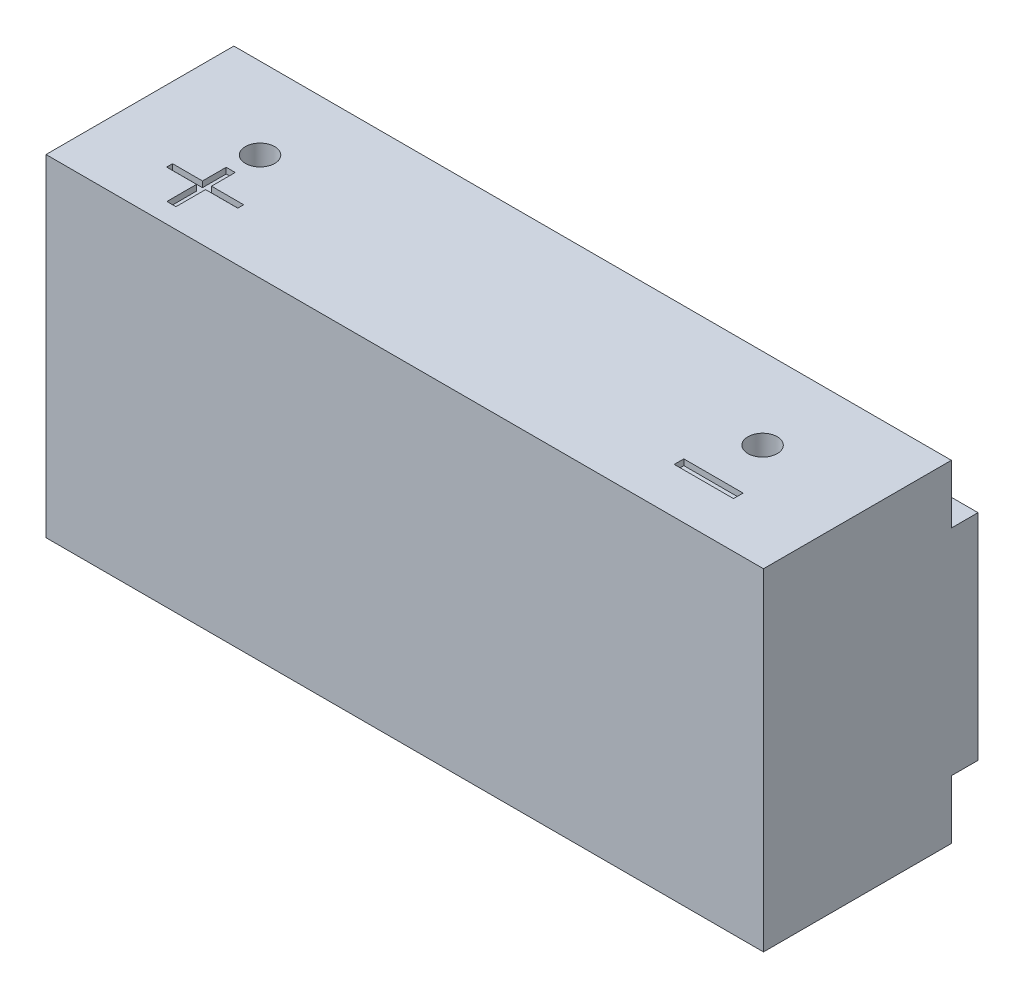
ISO-10303-21;
HEADER;
FILE_DESCRIPTION(('STEP AP214'),'2;1');
FILE_NAME('part.step','',(''),(''),'','','');
FILE_SCHEMA(('AUTOMOTIVE_DESIGN { 1 0 10303 214 1 1 1 1 }'));
ENDSEC;
DATA;
#1=APPLICATION_CONTEXT('core data for automotive mechanical design processes');
#2=APPLICATION_PROTOCOL_DEFINITION('international standard','automotive_design',2000,#1);
#3=PRODUCT_CONTEXT('',#1,'mechanical');
#4=PRODUCT('Part','Part','',(#3));
#5=PRODUCT_RELATED_PRODUCT_CATEGORY('part','',(#4));
#6=PRODUCT_DEFINITION_FORMATION('','',#4);
#7=PRODUCT_DEFINITION_CONTEXT('part definition',#1,'design');
#8=PRODUCT_DEFINITION('design','',#6,#7);
#9=PRODUCT_DEFINITION_SHAPE('','',#8);
#10=(LENGTH_UNIT() NAMED_UNIT(*) SI_UNIT(.MILLI.,.METRE.));
#11=(NAMED_UNIT(*) PLANE_ANGLE_UNIT() SI_UNIT($,.RADIAN.));
#12=(NAMED_UNIT(*) SI_UNIT($,.STERADIAN.) SOLID_ANGLE_UNIT());
#13=UNCERTAINTY_MEASURE_WITH_UNIT(LENGTH_MEASURE(1.E-05),#10,'distance_accuracy_value','');
#14=(GEOMETRIC_REPRESENTATION_CONTEXT(3) GLOBAL_UNCERTAINTY_ASSIGNED_CONTEXT((#13)) GLOBAL_UNIT_ASSIGNED_CONTEXT((#10,
#11,#12)) REPRESENTATION_CONTEXT('',''));
#15=CARTESIAN_POINT('',(0.,0.,0.));
#16=DIRECTION('',(0.,0.,1.));
#17=DIRECTION('',(1.,0.,0.));
#18=AXIS2_PLACEMENT_3D('',#15,#16,#17);
#19=CARTESIAN_POINT('',(0.,143.6878,-92.869200088));
#20=DIRECTION('',(0.,0.,1.));
#21=DIRECTION('',(1.,0.,0.));
#22=AXIS2_PLACEMENT_3D('',#19,#20,#21);
#23=PLANE('',#22);
#24=DIRECTION('',(1.,0.,0.));
#25=VECTOR('',#24,1.);
#26=CARTESIAN_POINT('',(0.,25.4,-92.869200088));
#27=LINE('',#26,#25);
#28=CARTESIAN_POINT('',(0.,25.4,-92.869200088));
#29=VERTEX_POINT('',#28);
#30=CARTESIAN_POINT('',(310.63946,25.4,-92.869200088));
#31=VERTEX_POINT('',#30);
#32=EDGE_CURVE('E400',#29,#31,#27,.T.);
#33=ORIENTED_EDGE('',*,*,#32,.F.);
#34=DIRECTION('',(0.,-1.,0.));
#35=VECTOR('',#34,1.);
#36=CARTESIAN_POINT('',(0.,143.6878,-92.869200088));
#37=LINE('',#36,#35);
#38=CARTESIAN_POINT('',(0.,118.2878,-92.869200088));
#39=VERTEX_POINT('',#38);
#40=EDGE_CURVE('E451',#39,#29,#37,.T.);
#41=ORIENTED_EDGE('',*,*,#40,.F.);
#42=DIRECTION('',(-1.,0.,0.));
#43=VECTOR('',#42,1.);
#44=CARTESIAN_POINT('',(0.,118.2878,-92.869200088));
#45=LINE('',#44,#43);
#46=CARTESIAN_POINT('',(310.63946,118.2878,-92.869200088));
#47=VERTEX_POINT('',#46);
#48=EDGE_CURVE('E49',#47,#39,#45,.T.);
#49=ORIENTED_EDGE('',*,*,#48,.F.);
#50=DIRECTION('',(0.,-1.,0.));
#51=VECTOR('',#50,1.);
#52=CARTESIAN_POINT('',(310.63946,143.6878,-92.869200088));
#53=LINE('',#52,#51);
#54=EDGE_CURVE('E463',#47,#31,#53,.T.);
#55=ORIENTED_EDGE('',*,*,#54,.T.);
#56=EDGE_LOOP('',(#33,#41,#49,#55));
#57=FACE_BOUND('',#56,.T.);
#58=ADVANCED_FACE('F40',(#57),#23,.F.);
#59=CARTESIAN_POINT('',(0.,143.6878,0.));
#60=DIRECTION('',(1.,0.,0.));
#61=DIRECTION('',(0.,0.,-1.));
#62=AXIS2_PLACEMENT_3D('',#59,#60,#61);
#63=PLANE('',#62);
#64=DIRECTION('',(0.,-1.,0.));
#65=VECTOR('',#64,1.);
#66=CARTESIAN_POINT('',(0.,25.4,-81.33842));
#67=LINE('',#66,#65);
#68=CARTESIAN_POINT('',(0.,25.4,-81.33842));
#69=VERTEX_POINT('',#68);
#70=CARTESIAN_POINT('',(0.,0.,-81.33842));
#71=VERTEX_POINT('',#70);
#72=EDGE_CURVE('E390',#69,#71,#67,.T.);
#73=ORIENTED_EDGE('',*,*,#72,.T.);
#74=DIRECTION('',(0.,0.,1.));
#75=VECTOR('',#74,1.);
#76=CARTESIAN_POINT('',(0.,0.,0.));
#77=LINE('',#76,#75);
#78=CARTESIAN_POINT('',(0.,0.,0.));
#79=VERTEX_POINT('',#78);
#80=EDGE_CURVE('E428',#71,#79,#77,.T.);
#81=ORIENTED_EDGE('',*,*,#80,.T.);
#82=DIRECTION('',(0.,-1.,0.));
#83=VECTOR('',#82,1.);
#84=CARTESIAN_POINT('',(0.,143.6878,0.));
#85=LINE('',#84,#83);
#86=CARTESIAN_POINT('',(0.,143.6878,0.));
#87=VERTEX_POINT('',#86);
#88=EDGE_CURVE('E471',#87,#79,#85,.T.);
#89=ORIENTED_EDGE('',*,*,#88,.F.);
#90=DIRECTION('',(0.,0.,1.));
#91=VECTOR('',#90,1.);
#92=CARTESIAN_POINT('',(0.,143.6878,0.));
#93=LINE('',#92,#91);
#94=CARTESIAN_POINT('',(0.,143.6878,-81.33842));
#95=VERTEX_POINT('',#94);
#96=EDGE_CURVE('E440',#95,#87,#93,.T.);
#97=ORIENTED_EDGE('',*,*,#96,.F.);
#98=DIRECTION('',(0.,1.,0.));
#99=VECTOR('',#98,1.);
#100=CARTESIAN_POINT('',(0.,118.2878,-81.33842));
#101=LINE('',#100,#99);
#102=CARTESIAN_POINT('',(0.,118.2878,-81.33842));
#103=VERTEX_POINT('',#102);
#104=EDGE_CURVE('E411',#103,#95,#101,.T.);
#105=ORIENTED_EDGE('',*,*,#104,.F.);
#106=DIRECTION('',(0.,0.,1.));
#107=VECTOR('',#106,1.);
#108=CARTESIAN_POINT('',(0.,118.2878,-94.03842));
#109=LINE('',#108,#107);
#110=EDGE_CURVE('E404',#39,#103,#109,.T.);
#111=ORIENTED_EDGE('',*,*,#110,.F.);
#112=ORIENTED_EDGE('',*,*,#40,.T.);
#113=DIRECTION('',(0.,0.,1.));
#114=VECTOR('',#113,1.);
#115=CARTESIAN_POINT('',(0.,25.4,-94.03842));
#116=LINE('',#115,#114);
#117=EDGE_CURVE('E382',#29,#69,#116,.T.);
#118=ORIENTED_EDGE('',*,*,#117,.T.);
#119=EDGE_LOOP('',(#73,#81,#89,#97,#105,#111,#112,#118));
#120=FACE_BOUND('',#119,.T.);
#121=ADVANCED_FACE('F42',(#120),#63,.F.);
#122=CARTESIAN_POINT('',(310.63946,143.6878,0.));
#123=DIRECTION('',(-1.,0.,0.));
#124=DIRECTION('',(0.,0.,1.));
#125=AXIS2_PLACEMENT_3D('',#122,#123,#124);
#126=PLANE('',#125);
#127=DIRECTION('',(0.,-1.,0.));
#128=VECTOR('',#127,1.);
#129=CARTESIAN_POINT('',(310.63946,143.6878,-81.33842));
#130=LINE('',#129,#128);
#131=CARTESIAN_POINT('',(310.63946,25.4,-81.33842));
#132=VERTEX_POINT('',#131);
#133=CARTESIAN_POINT('',(310.63946,0.,-81.33842));
#134=VERTEX_POINT('',#133);
#135=EDGE_CURVE('E397',#132,#134,#130,.T.);
#136=ORIENTED_EDGE('',*,*,#135,.F.);
#137=DIRECTION('',(0.,0.,1.));
#138=VECTOR('',#137,1.);
#139=CARTESIAN_POINT('',(310.63946,25.4,0.));
#140=LINE('',#139,#138);
#141=EDGE_CURVE('E11',#31,#132,#140,.T.);
#142=ORIENTED_EDGE('',*,*,#141,.F.);
#143=ORIENTED_EDGE('',*,*,#54,.F.);
#144=DIRECTION('',(0.,0.,-1.));
#145=VECTOR('',#144,1.);
#146=CARTESIAN_POINT('',(310.63946,118.2878,0.));
#147=LINE('',#146,#145);
#148=CARTESIAN_POINT('',(310.63946,118.2878,-81.33842));
#149=VERTEX_POINT('',#148);
#150=EDGE_CURVE('E420',#149,#47,#147,.T.);
#151=ORIENTED_EDGE('',*,*,#150,.F.);
#152=DIRECTION('',(0.,1.,0.));
#153=VECTOR('',#152,1.);
#154=CARTESIAN_POINT('',(310.63946,143.6878,-81.33842));
#155=LINE('',#154,#153);
#156=CARTESIAN_POINT('',(310.63946,143.6878,-81.33842));
#157=VERTEX_POINT('',#156);
#158=EDGE_CURVE('E416',#149,#157,#155,.T.);
#159=ORIENTED_EDGE('',*,*,#158,.T.);
#160=DIRECTION('',(0.,0.,-1.));
#161=VECTOR('',#160,1.);
#162=CARTESIAN_POINT('',(310.63946,143.6878,0.));
#163=LINE('',#162,#161);
#164=CARTESIAN_POINT('',(310.63946,143.6878,0.));
#165=VERTEX_POINT('',#164);
#166=EDGE_CURVE('E447',#165,#157,#163,.T.);
#167=ORIENTED_EDGE('',*,*,#166,.F.);
#168=DIRECTION('',(0.,-1.,0.));
#169=VECTOR('',#168,1.);
#170=CARTESIAN_POINT('',(310.63946,143.6878,0.));
#171=LINE('',#170,#169);
#172=CARTESIAN_POINT('',(310.63946,0.,0.));
#173=VERTEX_POINT('',#172);
#174=EDGE_CURVE('E467',#165,#173,#171,.T.);
#175=ORIENTED_EDGE('',*,*,#174,.T.);
#176=DIRECTION('',(0.,0.,-1.));
#177=VECTOR('',#176,1.);
#178=CARTESIAN_POINT('',(310.63946,0.,0.));
#179=LINE('',#178,#177);
#180=EDGE_CURVE('E444',#173,#134,#179,.T.);
#181=ORIENTED_EDGE('',*,*,#180,.T.);
#182=EDGE_LOOP('',(#136,#142,#143,#151,#159,#167,#175,#181));
#183=FACE_BOUND('',#182,.T.);
#184=ADVANCED_FACE('F493',(#183),#126,.F.);
#185=CARTESIAN_POINT('',(0.,0.,0.));
#186=DIRECTION('',(0.,-1.,0.));
#187=DIRECTION('',(0.,0.,-1.));
#188=AXIS2_PLACEMENT_3D('',#185,#186,#187);
#189=PLANE('',#188);
#190=CARTESIAN_POINT('',(46.5328,0.,-46.14164));
#191=DIRECTION('',(0.,1.,0.));
#192=DIRECTION('',(0.,0.,1.));
#193=AXIS2_PLACEMENT_3D('',#190,#191,#192);
#194=CIRCLE('',#193,6.35);
#195=CARTESIAN_POINT('',(46.5328,0.,-39.79164));
#196=VERTEX_POINT('',#195);
#197=EDGE_CURVE('E424',#196,#196,#194,.T.);
#198=ORIENTED_EDGE('',*,*,#197,.T.);
#199=EDGE_LOOP('',(#198));
#200=FACE_BOUND('',#199,.T.);
#201=CARTESIAN_POINT('',(264.10666,0.,-46.14164));
#202=DIRECTION('',(0.,1.,0.));
#203=DIRECTION('',(0.,0.,-1.));
#204=AXIS2_PLACEMENT_3D('',#201,#202,#203);
#205=CIRCLE('',#204,6.35);
#206=CARTESIAN_POINT('',(264.10666,0.,-52.49164));
#207=VERTEX_POINT('',#206);
#208=EDGE_CURVE('E433',#207,#207,#205,.T.);
#209=ORIENTED_EDGE('',*,*,#208,.T.);
#210=EDGE_LOOP('',(#209));
#211=FACE_BOUND('',#210,.T.);
#212=ORIENTED_EDGE('',*,*,#80,.F.);
#213=DIRECTION('',(1.,0.,0.));
#214=VECTOR('',#213,1.);
#215=CARTESIAN_POINT('',(0.,0.,-81.33842));
#216=LINE('',#215,#214);
#217=EDGE_CURVE('E311',#71,#134,#216,.T.);
#218=ORIENTED_EDGE('',*,*,#217,.T.);
#219=ORIENTED_EDGE('',*,*,#180,.F.);
#220=DIRECTION('',(1.,0.,0.));
#221=VECTOR('',#220,1.);
#222=CARTESIAN_POINT('',(0.,0.,0.));
#223=LINE('',#222,#221);
#224=EDGE_CURVE('E454',#79,#173,#223,.T.);
#225=ORIENTED_EDGE('',*,*,#224,.F.);
#226=EDGE_LOOP('',(#212,#218,#219,#225));
#227=FACE_BOUND('',#226,.T.);
#228=ADVANCED_FACE('F500',(#200,#211,#227),#189,.T.);
#229=CARTESIAN_POINT('',(0.,143.6878,0.));
#230=DIRECTION('',(0.,0.,-1.));
#231=DIRECTION('',(-1.,0.,0.));
#232=AXIS2_PLACEMENT_3D('',#229,#230,#231);
#233=PLANE('',#232);
#234=ORIENTED_EDGE('',*,*,#224,.T.);
#235=ORIENTED_EDGE('',*,*,#174,.F.);
#236=DIRECTION('',(1.,0.,0.));
#237=VECTOR('',#236,1.);
#238=CARTESIAN_POINT('',(0.,143.6878,0.));
#239=LINE('',#238,#237);
#240=EDGE_CURVE('E443',#87,#165,#239,.T.);
#241=ORIENTED_EDGE('',*,*,#240,.F.);
#242=ORIENTED_EDGE('',*,*,#88,.T.);
#243=EDGE_LOOP('',(#234,#235,#241,#242));
#244=FACE_BOUND('',#243,.T.);
#245=ADVANCED_FACE('F505',(#244),#233,.F.);
#246=CARTESIAN_POINT('',(0.,143.6878,0.));
#247=DIRECTION('',(0.,-1.,0.));
#248=DIRECTION('',(0.,0.,-1.));
#249=AXIS2_PLACEMENT_3D('',#246,#247,#248);
#250=PLANE('',#249);
#251=DIRECTION('',(-1.,0.,0.));
#252=VECTOR('',#251,1.);
#253=CARTESIAN_POINT('',(30.8371459823256,143.6878,-23.9568812419867));
#254=LINE('',#253,#252);
#255=CARTESIAN_POINT('',(43.7862665965292,143.6878,-23.9568812419867));
#256=VERTEX_POINT('',#255);
#257=CARTESIAN_POINT('',(30.8371459823256,143.6878,-23.9568812419867));
#258=VERTEX_POINT('',#257);
#259=EDGE_CURVE('E269',#256,#258,#254,.T.);
#260=ORIENTED_EDGE('',*,*,#259,.F.);
#261=DIRECTION('',(0.,0.,1.));
#262=VECTOR('',#261,1.);
#263=CARTESIAN_POINT('',(43.7862665965292,143.6878,-34.2184485211669));
#264=LINE('',#263,#262);
#265=CARTESIAN_POINT('',(43.7862665965292,143.6878,-34.2184485211669));
#266=VERTEX_POINT('',#265);
#267=EDGE_CURVE('E56',#266,#256,#264,.T.);
#268=ORIENTED_EDGE('',*,*,#267,.F.);
#269=DIRECTION('',(-1.,0.,0.));
#270=VECTOR('',#269,1.);
#271=CARTESIAN_POINT('',(43.7862665965292,143.6878,-34.2184485211669));
#272=LINE('',#271,#270);
#273=CARTESIAN_POINT('',(47.695435083836,143.6878,-34.2184485211669));
#274=VERTEX_POINT('',#273);
#275=EDGE_CURVE('E225',#274,#266,#272,.T.);
#276=ORIENTED_EDGE('',*,*,#275,.F.);
#277=DIRECTION('',(0.,0.,-1.));
#278=VECTOR('',#277,1.);
#279=CARTESIAN_POINT('',(47.695435083836,143.6878,-34.2184485211669));
#280=LINE('',#279,#278);
#281=CARTESIAN_POINT('',(47.695435083836,143.6878,-23.9568812419867));
#282=VERTEX_POINT('',#281);
#283=EDGE_CURVE('E229',#282,#274,#280,.T.);
#284=ORIENTED_EDGE('',*,*,#283,.F.);
#285=DIRECTION('',(-1.,0.,0.));
#286=VECTOR('',#285,1.);
#287=CARTESIAN_POINT('',(47.695435083836,143.6878,-23.9568812419867));
#288=LINE('',#287,#286);
#289=CARTESIAN_POINT('',(61.6218478198663,143.6878,-23.9568812419867));
#290=VERTEX_POINT('',#289);
#291=EDGE_CURVE('E301',#290,#282,#288,.T.);
#292=ORIENTED_EDGE('',*,*,#291,.F.);
#293=DIRECTION('',(0.,0.,-1.));
#294=VECTOR('',#293,1.);
#295=CARTESIAN_POINT('',(61.6218478198663,143.6878,-23.9568812419867));
#296=LINE('',#295,#294);
#297=CARTESIAN_POINT('',(61.6218478198663,143.6878,-21.3914894221916));
#298=VERTEX_POINT('',#297);
#299=EDGE_CURVE('E297',#298,#290,#296,.T.);
#300=ORIENTED_EDGE('',*,*,#299,.F.);
#301=DIRECTION('',(1.,0.,0.));
#302=VECTOR('',#301,1.);
#303=CARTESIAN_POINT('',(47.695435083836,143.6878,-21.3914894221916));
#304=LINE('',#303,#302);
#305=CARTESIAN_POINT('',(47.695435083836,143.6878,-21.3914894221916));
#306=VERTEX_POINT('',#305);
#307=EDGE_CURVE('E293',#306,#298,#304,.T.);
#308=ORIENTED_EDGE('',*,*,#307,.F.);
#309=DIRECTION('',(0.,0.,-1.));
#310=VECTOR('',#309,1.);
#311=CARTESIAN_POINT('',(47.695435083836,143.6878,-21.3914894221916));
#312=LINE('',#311,#310);
#313=CARTESIAN_POINT('',(47.695435083836,143.6878,-8.56453032321633));
#314=VERTEX_POINT('',#313);
#315=EDGE_CURVE('E289',#314,#306,#312,.T.);
#316=ORIENTED_EDGE('',*,*,#315,.F.);
#317=DIRECTION('',(1.,0.,0.));
#318=VECTOR('',#317,1.);
#319=CARTESIAN_POINT('',(43.7862665965292,143.6878,-8.56453032321633));
#320=LINE('',#319,#318);
#321=CARTESIAN_POINT('',(43.7862665965292,143.6878,-8.56453032321633));
#322=VERTEX_POINT('',#321);
#323=EDGE_CURVE('E285',#322,#314,#320,.T.);
#324=ORIENTED_EDGE('',*,*,#323,.F.);
#325=DIRECTION('',(0.,0.,1.));
#326=VECTOR('',#325,1.);
#327=CARTESIAN_POINT('',(43.7862665965292,143.6878,-21.3914894221916));
#328=LINE('',#327,#326);
#329=CARTESIAN_POINT('',(43.7862665965292,143.6878,-21.3914894221916));
#330=VERTEX_POINT('',#329);
#331=EDGE_CURVE('E281',#330,#322,#328,.T.);
#332=ORIENTED_EDGE('',*,*,#331,.F.);
#333=DIRECTION('',(1.,0.,0.));
#334=VECTOR('',#333,1.);
#335=CARTESIAN_POINT('',(30.8371459823256,143.6878,-21.3914894221916));
#336=LINE('',#335,#334);
#337=CARTESIAN_POINT('',(30.8371459823256,143.6878,-21.3914894221916));
#338=VERTEX_POINT('',#337);
#339=EDGE_CURVE('E277',#338,#330,#336,.T.);
#340=ORIENTED_EDGE('',*,*,#339,.F.);
#341=DIRECTION('',(0.,0.,1.));
#342=VECTOR('',#341,1.);
#343=CARTESIAN_POINT('',(30.8371459823256,143.6878,-23.9568812419867));
#344=LINE('',#343,#342);
#345=EDGE_CURVE('E273',#258,#338,#344,.T.);
#346=ORIENTED_EDGE('',*,*,#345,.F.);
#347=EDGE_LOOP('',(#260,#268,#276,#284,#292,#300,#308,#316,#324,#332,#340,#346));
#348=FACE_BOUND('',#347,.T.);
#349=DIRECTION('',(1.,0.,0.));
#350=VECTOR('',#349,1.);
#351=CARTESIAN_POINT('',(252.193811576071,143.6878,-19.8033897242232));
#352=LINE('',#351,#350);
#353=CARTESIAN_POINT('',(252.193811576071,143.6878,-19.8033897242232));
#354=VERTEX_POINT('',#353);
#355=CARTESIAN_POINT('',(277.847729774021,143.6878,-19.8033897242232));
#356=VERTEX_POINT('',#355);
#357=EDGE_CURVE('E361',#354,#356,#352,.T.);
#358=ORIENTED_EDGE('',*,*,#357,.F.);
#359=DIRECTION('',(0.,0.,1.));
#360=VECTOR('',#359,1.);
#361=CARTESIAN_POINT('',(252.193811576071,143.6878,-23.9568812419867));
#362=LINE('',#361,#360);
#363=CARTESIAN_POINT('',(252.193811576071,143.6878,-23.9568812419867));
#364=VERTEX_POINT('',#363);
#365=EDGE_CURVE('E64',#364,#354,#362,.T.);
#366=ORIENTED_EDGE('',*,*,#365,.F.);
#367=DIRECTION('',(-1.,0.,0.));
#368=VECTOR('',#367,1.);
#369=CARTESIAN_POINT('',(252.193811576071,143.6878,-23.9568812419867));
#370=LINE('',#369,#368);
#371=CARTESIAN_POINT('',(277.847729774021,143.6878,-23.9568812419867));
#372=VERTEX_POINT('',#371);
#373=EDGE_CURVE('E346',#372,#364,#370,.T.);
#374=ORIENTED_EDGE('',*,*,#373,.F.);
#375=DIRECTION('',(0.,0.,-1.));
#376=VECTOR('',#375,1.);
#377=CARTESIAN_POINT('',(277.847729774021,143.6878,-23.9568812419867));
#378=LINE('',#377,#376);
#379=EDGE_CURVE('E365',#356,#372,#378,.T.);
#380=ORIENTED_EDGE('',*,*,#379,.F.);
#381=EDGE_LOOP('',(#358,#366,#374,#380));
#382=FACE_BOUND('',#381,.T.);
#383=CARTESIAN_POINT('',(46.5328,143.6878,-46.14164));
#384=DIRECTION('',(0.,1.,0.));
#385=DIRECTION('',(0.,0.,1.));
#386=AXIS2_PLACEMENT_3D('',#383,#384,#385);
#387=CIRCLE('',#386,6.35);
#388=CARTESIAN_POINT('',(46.5328,143.6878,-39.79164));
#389=VERTEX_POINT('',#388);
#390=EDGE_CURVE('E429',#389,#389,#387,.T.);
#391=ORIENTED_EDGE('',*,*,#390,.F.);
#392=EDGE_LOOP('',(#391));
#393=FACE_BOUND('',#392,.T.);
#394=CARTESIAN_POINT('',(264.10666,143.6878,-46.14164));
#395=DIRECTION('',(0.,1.,0.));
#396=DIRECTION('',(0.,0.,-1.));
#397=AXIS2_PLACEMENT_3D('',#394,#395,#396);
#398=CIRCLE('',#397,6.35);
#399=CARTESIAN_POINT('',(264.10666,143.6878,-52.49164));
#400=VERTEX_POINT('',#399);
#401=EDGE_CURVE('E423',#400,#400,#398,.T.);
#402=ORIENTED_EDGE('',*,*,#401,.F.);
#403=EDGE_LOOP('',(#402));
#404=FACE_BOUND('',#403,.T.);
#405=ORIENTED_EDGE('',*,*,#166,.T.);
#406=DIRECTION('',(1.,0.,0.));
#407=VECTOR('',#406,1.);
#408=CARTESIAN_POINT('',(0.,143.6878,-81.33842));
#409=LINE('',#408,#407);
#410=EDGE_CURVE('E403',#95,#157,#409,.T.);
#411=ORIENTED_EDGE('',*,*,#410,.F.);
#412=ORIENTED_EDGE('',*,*,#96,.T.);
#413=ORIENTED_EDGE('',*,*,#240,.T.);
#414=EDGE_LOOP('',(#405,#411,#412,#413));
#415=FACE_BOUND('',#414,.T.);
#416=ADVANCED_FACE('F509',(#348,#382,#393,#404,#415),#250,.F.);
#417=CARTESIAN_POINT('',(264.10666,0.,-46.14164));
#418=DIRECTION('',(0.,1.,0.));
#419=DIRECTION('',(0.,0.,1.));
#420=AXIS2_PLACEMENT_3D('',#417,#418,#419);
#421=CYLINDRICAL_SURFACE('',#420,6.35);
#422=ORIENTED_EDGE('',*,*,#208,.F.);
#423=EDGE_LOOP('',(#422));
#424=FACE_BOUND('',#423,.T.);
#425=ORIENTED_EDGE('',*,*,#401,.T.);
#426=EDGE_LOOP('',(#425));
#427=FACE_BOUND('',#426,.T.);
#428=ADVANCED_FACE('F538',(#424,#427),#421,.F.);
#429=CARTESIAN_POINT('',(46.5328,0.,-46.14164));
#430=DIRECTION('',(0.,1.,0.));
#431=DIRECTION('',(0.,0.,1.));
#432=AXIS2_PLACEMENT_3D('',#429,#430,#431);
#433=CYLINDRICAL_SURFACE('',#432,6.35);
#434=ORIENTED_EDGE('',*,*,#197,.F.);
#435=EDGE_LOOP('',(#434));
#436=FACE_BOUND('',#435,.T.);
#437=ORIENTED_EDGE('',*,*,#390,.T.);
#438=EDGE_LOOP('',(#437));
#439=FACE_BOUND('',#438,.T.);
#440=ADVANCED_FACE('F520',(#436,#439),#433,.F.);
#441=CARTESIAN_POINT('',(0.,118.2878,0.));
#442=DIRECTION('',(0.,1.,0.));
#443=DIRECTION('',(0.,0.,1.));
#444=AXIS2_PLACEMENT_3D('',#441,#442,#443);
#445=PLANE('',#444);
#446=ORIENTED_EDGE('',*,*,#150,.T.);
#447=ORIENTED_EDGE('',*,*,#48,.T.);
#448=ORIENTED_EDGE('',*,*,#110,.T.);
#449=DIRECTION('',(1.,0.,0.));
#450=VECTOR('',#449,1.);
#451=CARTESIAN_POINT('',(0.,118.2878,-81.33842));
#452=LINE('',#451,#450);
#453=EDGE_CURVE('E407',#103,#149,#452,.T.);
#454=ORIENTED_EDGE('',*,*,#453,.T.);
#455=EDGE_LOOP('',(#446,#447,#448,#454));
#456=FACE_BOUND('',#455,.T.);
#457=ADVANCED_FACE('F478',(#456),#445,.T.);
#458=CARTESIAN_POINT('',(0.,118.2878,-81.33842));
#459=DIRECTION('',(0.,0.,1.));
#460=DIRECTION('',(1.,0.,0.));
#461=AXIS2_PLACEMENT_3D('',#458,#459,#460);
#462=PLANE('',#461);
#463=ORIENTED_EDGE('',*,*,#453,.F.);
#464=ORIENTED_EDGE('',*,*,#104,.T.);
#465=ORIENTED_EDGE('',*,*,#410,.T.);
#466=ORIENTED_EDGE('',*,*,#158,.F.);
#467=EDGE_LOOP('',(#463,#464,#465,#466));
#468=FACE_BOUND('',#467,.T.);
#469=ADVANCED_FACE('F512',(#468),#462,.F.);
#470=CARTESIAN_POINT('',(0.,25.4,0.));
#471=DIRECTION('',(0.,-1.,0.));
#472=DIRECTION('',(0.,0.,1.));
#473=AXIS2_PLACEMENT_3D('',#470,#471,#472);
#474=PLANE('',#473);
#475=ORIENTED_EDGE('',*,*,#32,.T.);
#476=ORIENTED_EDGE('',*,*,#141,.T.);
#477=DIRECTION('',(1.,0.,0.));
#478=VECTOR('',#477,1.);
#479=CARTESIAN_POINT('',(0.,25.4,-81.33842));
#480=LINE('',#479,#478);
#481=EDGE_CURVE('E386',#69,#132,#480,.T.);
#482=ORIENTED_EDGE('',*,*,#481,.F.);
#483=ORIENTED_EDGE('',*,*,#117,.F.);
#484=EDGE_LOOP('',(#475,#476,#482,#483));
#485=FACE_BOUND('',#484,.T.);
#486=ADVANCED_FACE('F490',(#485),#474,.T.);
#487=CARTESIAN_POINT('',(0.,25.4,-81.33842));
#488=DIRECTION('',(0.,0.,-1.));
#489=DIRECTION('',(-1.,0.,0.));
#490=AXIS2_PLACEMENT_3D('',#487,#488,#489);
#491=PLANE('',#490);
#492=ORIENTED_EDGE('',*,*,#135,.T.);
#493=ORIENTED_EDGE('',*,*,#217,.F.);
#494=ORIENTED_EDGE('',*,*,#72,.F.);
#495=ORIENTED_EDGE('',*,*,#481,.T.);
#496=EDGE_LOOP('',(#492,#493,#494,#495));
#497=FACE_BOUND('',#496,.T.);
#498=ADVANCED_FACE('F496',(#497),#491,.T.);
#499=CARTESIAN_POINT('',(252.193811576071,141.1478,-23.9568812419867));
#500=DIRECTION('',(-1.,0.,0.));
#501=DIRECTION('',(0.,0.,1.));
#502=AXIS2_PLACEMENT_3D('',#499,#500,#501);
#503=PLANE('',#502);
#504=ORIENTED_EDGE('',*,*,#365,.T.);
#505=DIRECTION('',(0.,1.,0.));
#506=VECTOR('',#505,1.);
#507=CARTESIAN_POINT('',(252.193811576071,141.1478,-19.8033897242232));
#508=LINE('',#507,#506);
#509=CARTESIAN_POINT('',(252.193811576071,141.1478,-19.8033897242232));
#510=VERTEX_POINT('',#509);
#511=EDGE_CURVE('E358',#510,#354,#508,.T.);
#512=ORIENTED_EDGE('',*,*,#511,.F.);
#513=DIRECTION('',(0.,0.,1.));
#514=VECTOR('',#513,1.);
#515=CARTESIAN_POINT('',(252.193811576071,141.1478,-23.9568812419867));
#516=LINE('',#515,#514);
#517=CARTESIAN_POINT('',(252.193811576071,141.1478,-23.9568812419867));
#518=VERTEX_POINT('',#517);
#519=EDGE_CURVE('E341',#518,#510,#516,.T.);
#520=ORIENTED_EDGE('',*,*,#519,.F.);
#521=DIRECTION('',(0.,1.,0.));
#522=VECTOR('',#521,1.);
#523=CARTESIAN_POINT('',(252.193811576071,141.1478,-23.9568812419867));
#524=LINE('',#523,#522);
#525=EDGE_CURVE('E270',#518,#364,#524,.T.);
#526=ORIENTED_EDGE('',*,*,#525,.T.);
#527=EDGE_LOOP('',(#504,#512,#520,#526));
#528=FACE_BOUND('',#527,.T.);
#529=ADVANCED_FACE('F603',(#528),#503,.F.);
#530=CARTESIAN_POINT('',(252.193811576071,141.1478,-23.9568812419867));
#531=DIRECTION('',(0.,0.,-1.));
#532=DIRECTION('',(-1.,0.,0.));
#533=AXIS2_PLACEMENT_3D('',#530,#531,#532);
#534=PLANE('',#533);
#535=ORIENTED_EDGE('',*,*,#373,.T.);
#536=ORIENTED_EDGE('',*,*,#525,.F.);
#537=DIRECTION('',(-1.,0.,0.));
#538=VECTOR('',#537,1.);
#539=CARTESIAN_POINT('',(252.193811576071,141.1478,-23.9568812419867));
#540=LINE('',#539,#538);
#541=CARTESIAN_POINT('',(277.847729774021,141.1478,-23.9568812419867));
#542=VERTEX_POINT('',#541);
#543=EDGE_CURVE('E354',#542,#518,#540,.T.);
#544=ORIENTED_EDGE('',*,*,#543,.F.);
#545=DIRECTION('',(0.,1.,0.));
#546=VECTOR('',#545,1.);
#547=CARTESIAN_POINT('',(277.847729774021,141.1478,-23.9568812419867));
#548=LINE('',#547,#546);
#549=EDGE_CURVE('E374',#542,#372,#548,.T.);
#550=ORIENTED_EDGE('',*,*,#549,.T.);
#551=EDGE_LOOP('',(#535,#536,#544,#550));
#552=FACE_BOUND('',#551,.T.);
#553=ADVANCED_FACE('F616',(#552),#534,.F.);
#554=CARTESIAN_POINT('',(277.847729774021,141.1478,-23.9568812419867));
#555=DIRECTION('',(1.,0.,0.));
#556=DIRECTION('',(0.,0.,-1.));
#557=AXIS2_PLACEMENT_3D('',#554,#555,#556);
#558=PLANE('',#557);
#559=ORIENTED_EDGE('',*,*,#379,.T.);
#560=ORIENTED_EDGE('',*,*,#549,.F.);
#561=DIRECTION('',(0.,0.,-1.));
#562=VECTOR('',#561,1.);
#563=CARTESIAN_POINT('',(277.847729774021,141.1478,-23.9568812419867));
#564=LINE('',#563,#562);
#565=CARTESIAN_POINT('',(277.847729774021,141.1478,-19.8033897242232));
#566=VERTEX_POINT('',#565);
#567=EDGE_CURVE('E350',#566,#542,#564,.T.);
#568=ORIENTED_EDGE('',*,*,#567,.F.);
#569=DIRECTION('',(0.,1.,0.));
#570=VECTOR('',#569,1.);
#571=CARTESIAN_POINT('',(277.847729774021,141.1478,-19.8033897242232));
#572=LINE('',#571,#570);
#573=EDGE_CURVE('E377',#566,#356,#572,.T.);
#574=ORIENTED_EDGE('',*,*,#573,.T.);
#575=EDGE_LOOP('',(#559,#560,#568,#574));
#576=FACE_BOUND('',#575,.T.);
#577=ADVANCED_FACE('F625',(#576),#558,.F.);
#578=CARTESIAN_POINT('',(252.193811576071,141.1478,-19.8033897242232));
#579=DIRECTION('',(0.,0.,1.));
#580=DIRECTION('',(1.,0.,0.));
#581=AXIS2_PLACEMENT_3D('',#578,#579,#580);
#582=PLANE('',#581);
#583=ORIENTED_EDGE('',*,*,#357,.T.);
#584=ORIENTED_EDGE('',*,*,#573,.F.);
#585=DIRECTION('',(1.,0.,0.));
#586=VECTOR('',#585,1.);
#587=CARTESIAN_POINT('',(252.193811576071,141.1478,-19.8033897242232));
#588=LINE('',#587,#586);
#589=EDGE_CURVE('E345',#510,#566,#588,.T.);
#590=ORIENTED_EDGE('',*,*,#589,.F.);
#591=ORIENTED_EDGE('',*,*,#511,.T.);
#592=EDGE_LOOP('',(#583,#584,#590,#591));
#593=FACE_BOUND('',#592,.T.);
#594=ADVANCED_FACE('F635',(#593),#582,.F.);
#595=CARTESIAN_POINT('',(0.,141.1478,0.));
#596=DIRECTION('',(0.,1.,0.));
#597=DIRECTION('',(0.,0.,1.));
#598=AXIS2_PLACEMENT_3D('',#595,#596,#597);
#599=PLANE('',#598);
#600=ORIENTED_EDGE('',*,*,#519,.T.);
#601=ORIENTED_EDGE('',*,*,#589,.T.);
#602=ORIENTED_EDGE('',*,*,#567,.T.);
#603=ORIENTED_EDGE('',*,*,#543,.T.);
#604=EDGE_LOOP('',(#600,#601,#602,#603));
#605=FACE_BOUND('',#604,.T.);
#606=ADVANCED_FACE('F645',(#605),#599,.T.);
#607=CARTESIAN_POINT('',(43.7862665965292,141.1478,-34.2184485211669));
#608=DIRECTION('',(-1.,0.,0.));
#609=DIRECTION('',(0.,0.,1.));
#610=AXIS2_PLACEMENT_3D('',#607,#608,#609);
#611=PLANE('',#610);
#612=ORIENTED_EDGE('',*,*,#267,.T.);
#613=DIRECTION('',(0.,1.,0.));
#614=VECTOR('',#613,1.);
#615=CARTESIAN_POINT('',(43.7862665965292,141.1478,-23.9568812419867));
#616=LINE('',#615,#614);
#617=CARTESIAN_POINT('',(43.7862665965292,141.1478,-23.9568812419867));
#618=VERTEX_POINT('',#617);
#619=EDGE_CURVE('E199',#618,#256,#616,.T.);
#620=ORIENTED_EDGE('',*,*,#619,.F.);
#621=DIRECTION('',(0.,0.,1.));
#622=VECTOR('',#621,1.);
#623=CARTESIAN_POINT('',(43.7862665965292,141.1478,-34.2184485211669));
#624=LINE('',#623,#622);
#625=CARTESIAN_POINT('',(43.7862665965292,141.1478,-34.2184485211669));
#626=VERTEX_POINT('',#625);
#627=EDGE_CURVE('E203',#626,#618,#624,.T.);
#628=ORIENTED_EDGE('',*,*,#627,.F.);
#629=DIRECTION('',(0.,1.,0.));
#630=VECTOR('',#629,1.);
#631=CARTESIAN_POINT('',(43.7862665965292,141.1478,-34.2184485211669));
#632=LINE('',#631,#630);
#633=EDGE_CURVE('E308',#626,#266,#632,.T.);
#634=ORIENTED_EDGE('',*,*,#633,.T.);
#635=EDGE_LOOP('',(#612,#620,#628,#634));
#636=FACE_BOUND('',#635,.T.);
#637=ADVANCED_FACE('F201',(#636),#611,.F.);
#638=CARTESIAN_POINT('',(43.7862665965292,141.1478,-34.2184485211669));
#639=DIRECTION('',(0.,0.,-1.));
#640=DIRECTION('',(-1.,0.,0.));
#641=AXIS2_PLACEMENT_3D('',#638,#639,#640);
#642=PLANE('',#641);
#643=ORIENTED_EDGE('',*,*,#275,.T.);
#644=ORIENTED_EDGE('',*,*,#633,.F.);
#645=DIRECTION('',(-1.,0.,0.));
#646=VECTOR('',#645,1.);
#647=CARTESIAN_POINT('',(43.7862665965292,141.1478,-34.2184485211669));
#648=LINE('',#647,#646);
#649=CARTESIAN_POINT('',(47.695435083836,141.1478,-34.2184485211669));
#650=VERTEX_POINT('',#649);
#651=EDGE_CURVE('E210',#650,#626,#648,.T.);
#652=ORIENTED_EDGE('',*,*,#651,.F.);
#653=DIRECTION('',(0.,1.,0.));
#654=VECTOR('',#653,1.);
#655=CARTESIAN_POINT('',(47.695435083836,141.1478,-34.2184485211669));
#656=LINE('',#655,#654);
#657=EDGE_CURVE('E312',#650,#274,#656,.T.);
#658=ORIENTED_EDGE('',*,*,#657,.T.);
#659=EDGE_LOOP('',(#643,#644,#652,#658));
#660=FACE_BOUND('',#659,.T.);
#661=ADVANCED_FACE('F666',(#660),#642,.F.);
#662=CARTESIAN_POINT('',(47.695435083836,141.1478,-34.2184485211669));
#663=DIRECTION('',(1.,0.,0.));
#664=DIRECTION('',(0.,0.,-1.));
#665=AXIS2_PLACEMENT_3D('',#662,#663,#664);
#666=PLANE('',#665);
#667=ORIENTED_EDGE('',*,*,#283,.T.);
#668=ORIENTED_EDGE('',*,*,#657,.F.);
#669=DIRECTION('',(0.,0.,-1.));
#670=VECTOR('',#669,1.);
#671=CARTESIAN_POINT('',(47.695435083836,141.1478,-34.2184485211669));
#672=LINE('',#671,#670);
#673=CARTESIAN_POINT('',(47.695435083836,141.1478,-23.9568812419867));
#674=VERTEX_POINT('',#673);
#675=EDGE_CURVE('E262',#674,#650,#672,.T.);
#676=ORIENTED_EDGE('',*,*,#675,.F.);
#677=DIRECTION('',(0.,1.,0.));
#678=VECTOR('',#677,1.);
#679=CARTESIAN_POINT('',(47.695435083836,141.1478,-23.9568812419867));
#680=LINE('',#679,#678);
#681=EDGE_CURVE('E315',#674,#282,#680,.T.);
#682=ORIENTED_EDGE('',*,*,#681,.T.);
#683=EDGE_LOOP('',(#667,#668,#676,#682));
#684=FACE_BOUND('',#683,.T.);
#685=ADVANCED_FACE('F675',(#684),#666,.F.);
#686=CARTESIAN_POINT('',(47.695435083836,141.1478,-23.9568812419867));
#687=DIRECTION('',(0.,0.,-1.));
#688=DIRECTION('',(-1.,0.,0.));
#689=AXIS2_PLACEMENT_3D('',#686,#687,#688);
#690=PLANE('',#689);
#691=ORIENTED_EDGE('',*,*,#291,.T.);
#692=ORIENTED_EDGE('',*,*,#681,.F.);
#693=DIRECTION('',(-1.,0.,0.));
#694=VECTOR('',#693,1.);
#695=CARTESIAN_POINT('',(47.695435083836,141.1478,-23.9568812419867));
#696=LINE('',#695,#694);
#697=CARTESIAN_POINT('',(61.6218478198663,141.1478,-23.9568812419867));
#698=VERTEX_POINT('',#697);
#699=EDGE_CURVE('E258',#698,#674,#696,.T.);
#700=ORIENTED_EDGE('',*,*,#699,.F.);
#701=DIRECTION('',(0.,1.,0.));
#702=VECTOR('',#701,1.);
#703=CARTESIAN_POINT('',(61.6218478198663,141.1478,-23.9568812419867));
#704=LINE('',#703,#702);
#705=EDGE_CURVE('E318',#698,#290,#704,.T.);
#706=ORIENTED_EDGE('',*,*,#705,.T.);
#707=EDGE_LOOP('',(#691,#692,#700,#706));
#708=FACE_BOUND('',#707,.T.);
#709=ADVANCED_FACE('F685',(#708),#690,.F.);
#710=CARTESIAN_POINT('',(61.6218478198663,141.1478,-23.9568812419867));
#711=DIRECTION('',(1.,0.,0.));
#712=DIRECTION('',(0.,0.,-1.));
#713=AXIS2_PLACEMENT_3D('',#710,#711,#712);
#714=PLANE('',#713);
#715=ORIENTED_EDGE('',*,*,#299,.T.);
#716=ORIENTED_EDGE('',*,*,#705,.F.);
#717=DIRECTION('',(0.,0.,-1.));
#718=VECTOR('',#717,1.);
#719=CARTESIAN_POINT('',(61.6218478198663,141.1478,-23.9568812419867));
#720=LINE('',#719,#718);
#721=CARTESIAN_POINT('',(61.6218478198663,141.1478,-21.3914894221916));
#722=VERTEX_POINT('',#721);
#723=EDGE_CURVE('E254',#722,#698,#720,.T.);
#724=ORIENTED_EDGE('',*,*,#723,.F.);
#725=DIRECTION('',(0.,1.,0.));
#726=VECTOR('',#725,1.);
#727=CARTESIAN_POINT('',(61.6218478198663,141.1478,-21.3914894221916));
#728=LINE('',#727,#726);
#729=EDGE_CURVE('E321',#722,#298,#728,.T.);
#730=ORIENTED_EDGE('',*,*,#729,.T.);
#731=EDGE_LOOP('',(#715,#716,#724,#730));
#732=FACE_BOUND('',#731,.T.);
#733=ADVANCED_FACE('F695',(#732),#714,.F.);
#734=CARTESIAN_POINT('',(47.695435083836,141.1478,-21.3914894221916));
#735=DIRECTION('',(0.,0.,1.));
#736=DIRECTION('',(1.,0.,0.));
#737=AXIS2_PLACEMENT_3D('',#734,#735,#736);
#738=PLANE('',#737);
#739=ORIENTED_EDGE('',*,*,#307,.T.);
#740=ORIENTED_EDGE('',*,*,#729,.F.);
#741=DIRECTION('',(1.,0.,0.));
#742=VECTOR('',#741,1.);
#743=CARTESIAN_POINT('',(47.695435083836,141.1478,-21.3914894221916));
#744=LINE('',#743,#742);
#745=CARTESIAN_POINT('',(47.695435083836,141.1478,-21.3914894221916));
#746=VERTEX_POINT('',#745);
#747=EDGE_CURVE('E250',#746,#722,#744,.T.);
#748=ORIENTED_EDGE('',*,*,#747,.F.);
#749=DIRECTION('',(0.,1.,0.));
#750=VECTOR('',#749,1.);
#751=CARTESIAN_POINT('',(47.695435083836,141.1478,-21.3914894221916));
#752=LINE('',#751,#750);
#753=EDGE_CURVE('E324',#746,#306,#752,.T.);
#754=ORIENTED_EDGE('',*,*,#753,.T.);
#755=EDGE_LOOP('',(#739,#740,#748,#754));
#756=FACE_BOUND('',#755,.T.);
#757=ADVANCED_FACE('F705',(#756),#738,.F.);
#758=CARTESIAN_POINT('',(47.695435083836,141.1478,-21.3914894221916));
#759=DIRECTION('',(1.,0.,0.));
#760=DIRECTION('',(0.,0.,-1.));
#761=AXIS2_PLACEMENT_3D('',#758,#759,#760);
#762=PLANE('',#761);
#763=ORIENTED_EDGE('',*,*,#315,.T.);
#764=ORIENTED_EDGE('',*,*,#753,.F.);
#765=DIRECTION('',(0.,0.,-1.));
#766=VECTOR('',#765,1.);
#767=CARTESIAN_POINT('',(47.695435083836,141.1478,-21.3914894221916));
#768=LINE('',#767,#766);
#769=CARTESIAN_POINT('',(47.695435083836,141.1478,-8.56453032321633));
#770=VERTEX_POINT('',#769);
#771=EDGE_CURVE('E246',#770,#746,#768,.T.);
#772=ORIENTED_EDGE('',*,*,#771,.F.);
#773=DIRECTION('',(0.,1.,0.));
#774=VECTOR('',#773,1.);
#775=CARTESIAN_POINT('',(47.695435083836,141.1478,-8.56453032321633));
#776=LINE('',#775,#774);
#777=EDGE_CURVE('E327',#770,#314,#776,.T.);
#778=ORIENTED_EDGE('',*,*,#777,.T.);
#779=EDGE_LOOP('',(#763,#764,#772,#778));
#780=FACE_BOUND('',#779,.T.);
#781=ADVANCED_FACE('F715',(#780),#762,.F.);
#782=CARTESIAN_POINT('',(43.7862665965292,141.1478,-8.56453032321633));
#783=DIRECTION('',(0.,0.,1.));
#784=DIRECTION('',(1.,0.,0.));
#785=AXIS2_PLACEMENT_3D('',#782,#783,#784);
#786=PLANE('',#785);
#787=ORIENTED_EDGE('',*,*,#323,.T.);
#788=ORIENTED_EDGE('',*,*,#777,.F.);
#789=DIRECTION('',(1.,0.,0.));
#790=VECTOR('',#789,1.);
#791=CARTESIAN_POINT('',(43.7862665965292,141.1478,-8.56453032321633));
#792=LINE('',#791,#790);
#793=CARTESIAN_POINT('',(43.7862665965292,141.1478,-8.56453032321633));
#794=VERTEX_POINT('',#793);
#795=EDGE_CURVE('E242',#794,#770,#792,.T.);
#796=ORIENTED_EDGE('',*,*,#795,.F.);
#797=DIRECTION('',(0.,1.,0.));
#798=VECTOR('',#797,1.);
#799=CARTESIAN_POINT('',(43.7862665965292,141.1478,-8.56453032321633));
#800=LINE('',#799,#798);
#801=EDGE_CURVE('E330',#794,#322,#800,.T.);
#802=ORIENTED_EDGE('',*,*,#801,.T.);
#803=EDGE_LOOP('',(#787,#788,#796,#802));
#804=FACE_BOUND('',#803,.T.);
#805=ADVANCED_FACE('F725',(#804),#786,.F.);
#806=CARTESIAN_POINT('',(43.7862665965292,141.1478,-21.3914894221916));
#807=DIRECTION('',(-1.,0.,0.));
#808=DIRECTION('',(0.,0.,1.));
#809=AXIS2_PLACEMENT_3D('',#806,#807,#808);
#810=PLANE('',#809);
#811=ORIENTED_EDGE('',*,*,#331,.T.);
#812=ORIENTED_EDGE('',*,*,#801,.F.);
#813=DIRECTION('',(0.,0.,1.));
#814=VECTOR('',#813,1.);
#815=CARTESIAN_POINT('',(43.7862665965292,141.1478,-21.3914894221916));
#816=LINE('',#815,#814);
#817=CARTESIAN_POINT('',(43.7862665965292,141.1478,-21.3914894221916));
#818=VERTEX_POINT('',#817);
#819=EDGE_CURVE('E238',#818,#794,#816,.T.);
#820=ORIENTED_EDGE('',*,*,#819,.F.);
#821=DIRECTION('',(0.,1.,0.));
#822=VECTOR('',#821,1.);
#823=CARTESIAN_POINT('',(43.7862665965292,141.1478,-21.3914894221916));
#824=LINE('',#823,#822);
#825=EDGE_CURVE('E333',#818,#330,#824,.T.);
#826=ORIENTED_EDGE('',*,*,#825,.T.);
#827=EDGE_LOOP('',(#811,#812,#820,#826));
#828=FACE_BOUND('',#827,.T.);
#829=ADVANCED_FACE('F735',(#828),#810,.F.);
#830=CARTESIAN_POINT('',(30.8371459823256,141.1478,-21.3914894221916));
#831=DIRECTION('',(0.,0.,1.));
#832=DIRECTION('',(1.,0.,0.));
#833=AXIS2_PLACEMENT_3D('',#830,#831,#832);
#834=PLANE('',#833);
#835=ORIENTED_EDGE('',*,*,#339,.T.);
#836=ORIENTED_EDGE('',*,*,#825,.F.);
#837=DIRECTION('',(1.,0.,0.));
#838=VECTOR('',#837,1.);
#839=CARTESIAN_POINT('',(30.8371459823256,141.1478,-21.3914894221916));
#840=LINE('',#839,#838);
#841=CARTESIAN_POINT('',(30.8371459823256,141.1478,-21.3914894221916));
#842=VERTEX_POINT('',#841);
#843=EDGE_CURVE('E234',#842,#818,#840,.T.);
#844=ORIENTED_EDGE('',*,*,#843,.F.);
#845=DIRECTION('',(0.,1.,0.));
#846=VECTOR('',#845,1.);
#847=CARTESIAN_POINT('',(30.8371459823256,141.1478,-21.3914894221916));
#848=LINE('',#847,#846);
#849=EDGE_CURVE('E336',#842,#338,#848,.T.);
#850=ORIENTED_EDGE('',*,*,#849,.T.);
#851=EDGE_LOOP('',(#835,#836,#844,#850));
#852=FACE_BOUND('',#851,.T.);
#853=ADVANCED_FACE('F745',(#852),#834,.F.);
#854=CARTESIAN_POINT('',(30.8371459823256,141.1478,-23.9568812419867));
#855=DIRECTION('',(-1.,0.,0.));
#856=DIRECTION('',(0.,0.,1.));
#857=AXIS2_PLACEMENT_3D('',#854,#855,#856);
#858=PLANE('',#857);
#859=ORIENTED_EDGE('',*,*,#345,.T.);
#860=ORIENTED_EDGE('',*,*,#849,.F.);
#861=DIRECTION('',(0.,0.,1.));
#862=VECTOR('',#861,1.);
#863=CARTESIAN_POINT('',(30.8371459823256,141.1478,-23.9568812419867));
#864=LINE('',#863,#862);
#865=CARTESIAN_POINT('',(30.8371459823256,141.1478,-23.9568812419867));
#866=VERTEX_POINT('',#865);
#867=EDGE_CURVE('E219',#866,#842,#864,.T.);
#868=ORIENTED_EDGE('',*,*,#867,.F.);
#869=DIRECTION('',(0.,1.,0.));
#870=VECTOR('',#869,1.);
#871=CARTESIAN_POINT('',(30.8371459823256,141.1478,-23.9568812419867));
#872=LINE('',#871,#870);
#873=EDGE_CURVE('E209',#866,#258,#872,.T.);
#874=ORIENTED_EDGE('',*,*,#873,.T.);
#875=EDGE_LOOP('',(#859,#860,#868,#874));
#876=FACE_BOUND('',#875,.T.);
#877=ADVANCED_FACE('F755',(#876),#858,.F.);
#878=CARTESIAN_POINT('',(30.8371459823256,141.1478,-23.9568812419867));
#879=DIRECTION('',(0.,0.,-1.));
#880=DIRECTION('',(-1.,0.,0.));
#881=AXIS2_PLACEMENT_3D('',#878,#879,#880);
#882=PLANE('',#881);
#883=ORIENTED_EDGE('',*,*,#259,.T.);
#884=ORIENTED_EDGE('',*,*,#873,.F.);
#885=DIRECTION('',(-1.,0.,0.));
#886=VECTOR('',#885,1.);
#887=CARTESIAN_POINT('',(30.8371459823256,141.1478,-23.9568812419867));
#888=LINE('',#887,#886);
#889=EDGE_CURVE('E213',#618,#866,#888,.T.);
#890=ORIENTED_EDGE('',*,*,#889,.F.);
#891=ORIENTED_EDGE('',*,*,#619,.T.);
#892=EDGE_LOOP('',(#883,#884,#890,#891));
#893=FACE_BOUND('',#892,.T.);
#894=ADVANCED_FACE('F214',(#893),#882,.F.);
#895=CARTESIAN_POINT('',(0.,141.1478,0.));
#896=DIRECTION('',(0.,1.,0.));
#897=DIRECTION('',(0.,0.,1.));
#898=AXIS2_PLACEMENT_3D('',#895,#896,#897);
#899=PLANE('',#898);
#900=ORIENTED_EDGE('',*,*,#627,.T.);
#901=ORIENTED_EDGE('',*,*,#889,.T.);
#902=ORIENTED_EDGE('',*,*,#867,.T.);
#903=ORIENTED_EDGE('',*,*,#843,.T.);
#904=ORIENTED_EDGE('',*,*,#819,.T.);
#905=ORIENTED_EDGE('',*,*,#795,.T.);
#906=ORIENTED_EDGE('',*,*,#771,.T.);
#907=ORIENTED_EDGE('',*,*,#747,.T.);
#908=ORIENTED_EDGE('',*,*,#723,.T.);
#909=ORIENTED_EDGE('',*,*,#699,.T.);
#910=ORIENTED_EDGE('',*,*,#675,.T.);
#911=ORIENTED_EDGE('',*,*,#651,.T.);
#912=EDGE_LOOP('',(#900,#901,#902,#903,#904,#905,#906,#907,#908,#909,#910,#911));
#913=FACE_BOUND('',#912,.T.);
#914=ADVANCED_FACE('F221',(#913),#899,.T.);
#915=CLOSED_SHELL('',(#58,#121,#184,#228,#245,#416,#428,#440,#457,#469,#486,#498,#529,#553,#577,
#594,#606,#637,#661,#685,#709,#733,#757,#781,#805,#829,#853,#877,#894,#914));
#916=MANIFOLD_SOLID_BREP('B2',#915);
#917=ADVANCED_BREP_SHAPE_REPRESENTATION('',(#18,#916),#14);
#918=SHAPE_DEFINITION_REPRESENTATION(#9,#917);
ENDSEC;
END-ISO-10303-21;
